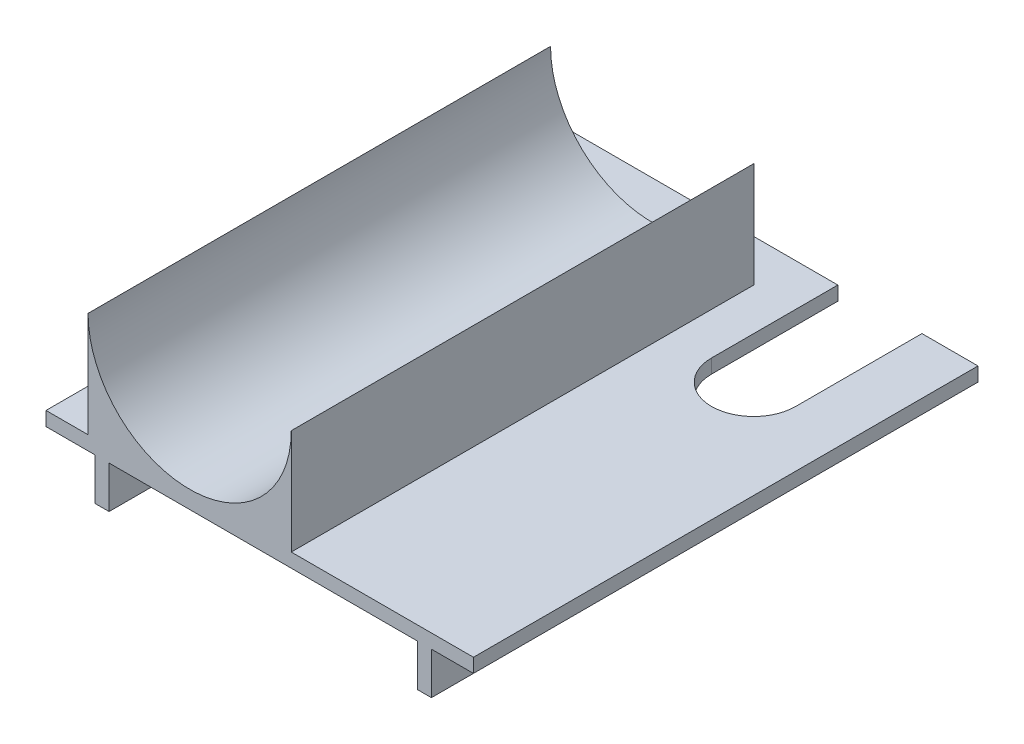
ISO-10303-21;
HEADER;
FILE_DESCRIPTION(('STEP AP214'),'2;1');
FILE_NAME('part.step','',(''),(''),'','','');
FILE_SCHEMA(('AUTOMOTIVE_DESIGN { 1 0 10303 214 1 1 1 1 }'));
ENDSEC;
DATA;
#1=APPLICATION_CONTEXT('core data for automotive mechanical design processes');
#2=APPLICATION_PROTOCOL_DEFINITION('international standard','automotive_design',2000,#1);
#3=PRODUCT_CONTEXT('',#1,'mechanical');
#4=PRODUCT('Part','Part','',(#3));
#5=PRODUCT_RELATED_PRODUCT_CATEGORY('part','',(#4));
#6=PRODUCT_DEFINITION_FORMATION('','',#4);
#7=PRODUCT_DEFINITION_CONTEXT('part definition',#1,'design');
#8=PRODUCT_DEFINITION('design','',#6,#7);
#9=PRODUCT_DEFINITION_SHAPE('','',#8);
#10=(LENGTH_UNIT() NAMED_UNIT(*) SI_UNIT(.MILLI.,.METRE.));
#11=(NAMED_UNIT(*) PLANE_ANGLE_UNIT() SI_UNIT($,.RADIAN.));
#12=(NAMED_UNIT(*) SI_UNIT($,.STERADIAN.) SOLID_ANGLE_UNIT());
#13=UNCERTAINTY_MEASURE_WITH_UNIT(LENGTH_MEASURE(1.E-05),#10,'distance_accuracy_value','');
#14=(GEOMETRIC_REPRESENTATION_CONTEXT(3) GLOBAL_UNCERTAINTY_ASSIGNED_CONTEXT((#13)) GLOBAL_UNIT_ASSIGNED_CONTEXT((#10,
#11,#12)) REPRESENTATION_CONTEXT('',''));
#15=CARTESIAN_POINT('',(0.,0.,0.));
#16=DIRECTION('',(0.,0.,1.));
#17=DIRECTION('',(1.,0.,0.));
#18=AXIS2_PLACEMENT_3D('',#15,#16,#17);
#19=CARTESIAN_POINT('',(-72.5,77.4999999999999,-360.));
#20=DIRECTION('',(-1.,0.,0.));
#21=DIRECTION('',(0.,0.,1.));
#22=AXIS2_PLACEMENT_3D('',#19,#20,#21);
#23=PLANE('',#22);
#24=DIRECTION('',(0.,0.,1.));
#25=VECTOR('',#24,1.);
#26=CARTESIAN_POINT('',(-72.5,77.4999999999999,-360.));
#27=LINE('',#26,#25);
#28=CARTESIAN_POINT('',(-72.5,77.4999999999999,-330.));
#29=VERTEX_POINT('',#28);
#30=CARTESIAN_POINT('',(-72.5,77.4999999999999,0.));
#31=VERTEX_POINT('',#30);
#32=EDGE_CURVE('E246',#29,#31,#27,.T.);
#33=ORIENTED_EDGE('',*,*,#32,.F.);
#34=DIRECTION('',(0.,-1.,0.));
#35=VECTOR('',#34,1.);
#36=CARTESIAN_POINT('',(-72.5,0.,-330.));
#37=LINE('',#36,#35);
#38=CARTESIAN_POINT('',(-72.5,2.49999999999995,-330.));
#39=VERTEX_POINT('',#38);
#40=EDGE_CURVE('E451',#29,#39,#37,.T.);
#41=ORIENTED_EDGE('',*,*,#40,.T.);
#42=DIRECTION('',(0.,0.,1.));
#43=VECTOR('',#42,1.);
#44=CARTESIAN_POINT('',(-72.5,2.49999999999995,-360.));
#45=LINE('',#44,#43);
#46=CARTESIAN_POINT('',(-72.5,2.49999999999995,0.));
#47=VERTEX_POINT('',#46);
#48=EDGE_CURVE('E244',#39,#47,#45,.T.);
#49=ORIENTED_EDGE('',*,*,#48,.T.);
#50=DIRECTION('',(0.,-1.,0.));
#51=VECTOR('',#50,1.);
#52=CARTESIAN_POINT('',(-72.5,77.4999999999999,0.));
#53=LINE('',#52,#51);
#54=EDGE_CURVE('E214',#31,#47,#53,.T.);
#55=ORIENTED_EDGE('',*,*,#54,.F.);
#56=EDGE_LOOP('',(#33,#41,#49,#55));
#57=FACE_BOUND('',#56,.T.);
#58=ADVANCED_FACE('F36',(#57),#23,.T.);
#59=CARTESIAN_POINT('',(0.,77.4999999999999,-360.));
#60=DIRECTION('',(0.,0.,1.));
#61=DIRECTION('',(1.,0.,0.));
#62=AXIS2_PLACEMENT_3D('',#59,#60,#61);
#63=CYLINDRICAL_SURFACE('',#62,72.5);
#64=DIRECTION('',(0.,0.,1.));
#65=VECTOR('',#64,1.);
#66=CARTESIAN_POINT('',(72.5,77.4999999999999,-360.));
#67=LINE('',#66,#65);
#68=CARTESIAN_POINT('',(72.5,77.4999999999999,-330.));
#69=VERTEX_POINT('',#68);
#70=CARTESIAN_POINT('',(72.5,77.4999999999999,0.));
#71=VERTEX_POINT('',#70);
#72=EDGE_CURVE('E248',#69,#71,#67,.T.);
#73=ORIENTED_EDGE('',*,*,#72,.F.);
#74=CARTESIAN_POINT('',(0.,77.4999999999999,-330.));
#75=DIRECTION('',(0.,0.,-1.));
#76=DIRECTION('',(-1.,0.,0.));
#77=AXIS2_PLACEMENT_3D('',#74,#75,#76);
#78=CIRCLE('',#77,72.5);
#79=EDGE_CURVE('E430',#69,#29,#78,.T.);
#80=ORIENTED_EDGE('',*,*,#79,.T.);
#81=ORIENTED_EDGE('',*,*,#32,.T.);
#82=CARTESIAN_POINT('',(0.,77.4999999999999,0.));
#83=DIRECTION('',(0.,0.,-1.));
#84=DIRECTION('',(1.,0.,0.));
#85=AXIS2_PLACEMENT_3D('',#82,#83,#84);
#86=CIRCLE('',#85,72.5);
#87=EDGE_CURVE('E211',#71,#31,#86,.T.);
#88=ORIENTED_EDGE('',*,*,#87,.F.);
#89=EDGE_LOOP('',(#73,#80,#81,#88));
#90=FACE_BOUND('',#89,.T.);
#91=ADVANCED_FACE('F292',(#90),#63,.F.);
#92=CARTESIAN_POINT('',(72.5,77.4999999999999,-360.));
#93=DIRECTION('',(1.,0.,0.));
#94=DIRECTION('',(0.,1.,0.));
#95=AXIS2_PLACEMENT_3D('',#92,#93,#94);
#96=PLANE('',#95);
#97=DIRECTION('',(0.,0.,1.));
#98=VECTOR('',#97,1.);
#99=CARTESIAN_POINT('',(72.5,2.49999999999995,-360.));
#100=LINE('',#99,#98);
#101=CARTESIAN_POINT('',(72.5,2.49999999999995,-330.));
#102=VERTEX_POINT('',#101);
#103=CARTESIAN_POINT('',(72.5,2.49999999999995,0.));
#104=VERTEX_POINT('',#103);
#105=EDGE_CURVE('E250',#102,#104,#100,.T.);
#106=ORIENTED_EDGE('',*,*,#105,.F.);
#107=DIRECTION('',(0.,1.,0.));
#108=VECTOR('',#107,1.);
#109=CARTESIAN_POINT('',(72.5,77.4999999999999,-330.));
#110=LINE('',#109,#108);
#111=EDGE_CURVE('E424',#102,#69,#110,.T.);
#112=ORIENTED_EDGE('',*,*,#111,.T.);
#113=ORIENTED_EDGE('',*,*,#72,.T.);
#114=DIRECTION('',(0.,1.,0.));
#115=VECTOR('',#114,1.);
#116=CARTESIAN_POINT('',(72.5,77.4999999999999,0.));
#117=LINE('',#116,#115);
#118=EDGE_CURVE('E208',#104,#71,#117,.T.);
#119=ORIENTED_EDGE('',*,*,#118,.F.);
#120=EDGE_LOOP('',(#106,#112,#113,#119));
#121=FACE_BOUND('',#120,.T.);
#122=ADVANCED_FACE('F288',(#121),#96,.T.);
#123=CARTESIAN_POINT('',(162.5,-7.50000000000005,-360.));
#124=DIRECTION('',(-1.,0.,0.));
#125=DIRECTION('',(0.,0.,1.));
#126=AXIS2_PLACEMENT_3D('',#123,#124,#125);
#127=PLANE('',#126);
#128=DIRECTION('',(0.,1.,0.));
#129=VECTOR('',#128,1.);
#130=CARTESIAN_POINT('',(162.5,-357.5,-269.791666666683));
#131=LINE('',#130,#129);
#132=CARTESIAN_POINT('',(162.5,-37.5000000000001,-269.791666666681));
#133=VERTEX_POINT('',#132);
#134=CARTESIAN_POINT('',(162.5,-7.50000000000001,-269.791666666683));
#135=VERTEX_POINT('',#134);
#136=EDGE_CURVE('E354',#133,#135,#131,.T.);
#137=ORIENTED_EDGE('',*,*,#136,.F.);
#138=DIRECTION('',(0.,0.,1.));
#139=VECTOR('',#138,1.);
#140=CARTESIAN_POINT('',(162.5,-37.5,-360.));
#141=LINE('',#140,#139);
#142=CARTESIAN_POINT('',(162.5,-37.5,0.));
#143=VERTEX_POINT('',#142);
#144=EDGE_CURVE('E40',#133,#143,#141,.T.);
#145=ORIENTED_EDGE('',*,*,#144,.T.);
#146=DIRECTION('',(0.,-1.,0.));
#147=VECTOR('',#146,1.);
#148=CARTESIAN_POINT('',(162.5,-7.50000000000005,0.));
#149=LINE('',#148,#147);
#150=CARTESIAN_POINT('',(162.5,-7.50000000000005,0.));
#151=VERTEX_POINT('',#150);
#152=EDGE_CURVE('E189',#151,#143,#149,.T.);
#153=ORIENTED_EDGE('',*,*,#152,.F.);
#154=DIRECTION('',(0.,0.,1.));
#155=VECTOR('',#154,1.);
#156=CARTESIAN_POINT('',(162.5,-7.50000000000005,-360.));
#157=LINE('',#156,#155);
#158=EDGE_CURVE('E118',#135,#151,#157,.T.);
#159=ORIENTED_EDGE('',*,*,#158,.F.);
#160=EDGE_LOOP('',(#137,#145,#153,#159));
#161=FACE_BOUND('',#160,.T.);
#162=ADVANCED_FACE('F291',(#161),#127,.T.);
#163=CARTESIAN_POINT('',(0.,77.4999999999999,-360.));
#164=DIRECTION('',(0.,0.,1.));
#165=DIRECTION('',(1.,0.,0.));
#166=AXIS2_PLACEMENT_3D('',#163,#164,#165);
#167=PLANE('',#166);
#168=DIRECTION('',(0.,-1.,0.));
#169=VECTOR('',#168,1.);
#170=CARTESIAN_POINT('',(162.5,-7.50000000000005,-360.));
#171=LINE('',#170,#169);
#172=CARTESIAN_POINT('',(162.5,2.49999999999995,-360.));
#173=VERTEX_POINT('',#172);
#174=CARTESIAN_POINT('',(162.5,-37.5,-360.));
#175=VERTEX_POINT('',#174);
#176=EDGE_CURVE('E235',#173,#175,#171,.T.);
#177=ORIENTED_EDGE('',*,*,#176,.F.);
#178=DIRECTION('',(-1.,0.,0.));
#179=VECTOR('',#178,1.);
#180=CARTESIAN_POINT('',(72.5,2.49999999999995,-360.));
#181=LINE('',#180,#179);
#182=CARTESIAN_POINT('',(202.5,2.49999999999995,-360.));
#183=VERTEX_POINT('',#182);
#184=EDGE_CURVE('E381',#183,#173,#181,.T.);
#185=ORIENTED_EDGE('',*,*,#184,.F.);
#186=DIRECTION('',(0.,1.,0.));
#187=VECTOR('',#186,1.);
#188=CARTESIAN_POINT('',(202.5,-7.50000000000005,-360.));
#189=LINE('',#188,#187);
#190=CARTESIAN_POINT('',(202.5,-7.50000000000005,-360.));
#191=VERTEX_POINT('',#190);
#192=EDGE_CURVE('E386',#191,#183,#189,.T.);
#193=ORIENTED_EDGE('',*,*,#192,.F.);
#194=DIRECTION('',(1.,0.,0.));
#195=VECTOR('',#194,1.);
#196=CARTESIAN_POINT('',(172.5,-7.50000000000005,-360.));
#197=LINE('',#196,#195);
#198=CARTESIAN_POINT('',(172.5,-7.50000000000005,-360.));
#199=VERTEX_POINT('',#198);
#200=EDGE_CURVE('E389',#199,#191,#197,.T.);
#201=ORIENTED_EDGE('',*,*,#200,.F.);
#202=DIRECTION('',(0.,1.,0.));
#203=VECTOR('',#202,1.);
#204=CARTESIAN_POINT('',(172.5,-37.5,-360.));
#205=LINE('',#204,#203);
#206=CARTESIAN_POINT('',(172.5,-37.5,-360.));
#207=VERTEX_POINT('',#206);
#208=EDGE_CURVE('E392',#207,#199,#205,.T.);
#209=ORIENTED_EDGE('',*,*,#208,.F.);
#210=DIRECTION('',(1.,0.,0.));
#211=VECTOR('',#210,1.);
#212=CARTESIAN_POINT('',(162.5,-37.5,-360.));
#213=LINE('',#212,#211);
#214=EDGE_CURVE('E395',#175,#207,#213,.T.);
#215=ORIENTED_EDGE('',*,*,#214,.F.);
#216=EDGE_LOOP('',(#177,#185,#193,#201,#209,#215));
#217=FACE_BOUND('',#216,.T.);
#218=ADVANCED_FACE('F329',(#217),#167,.F.);
#219=DIRECTION('',(0.,1.,0.));
#220=VECTOR('',#219,1.);
#221=CARTESIAN_POINT('',(162.5,-357.5,-270.));
#222=LINE('',#221,#220);
#223=CARTESIAN_POINT('',(162.5,-37.5000000000002,-270.));
#224=VERTEX_POINT('',#223);
#225=CARTESIAN_POINT('',(162.5,2.49999999999995,-270.));
#226=VERTEX_POINT('',#225);
#227=EDGE_CURVE('E344',#224,#226,#222,.T.);
#228=ORIENTED_EDGE('',*,*,#227,.T.);
#229=DIRECTION('',(0.,0.,-1.));
#230=VECTOR('',#229,1.);
#231=CARTESIAN_POINT('',(162.5,2.49999999999995,-270.));
#232=LINE('',#231,#230);
#233=EDGE_CURVE('E360',#226,#173,#232,.T.);
#234=ORIENTED_EDGE('',*,*,#233,.T.);
#235=ORIENTED_EDGE('',*,*,#176,.T.);
#236=EDGE_CURVE('E127',#175,#224,#141,.T.);
#237=ORIENTED_EDGE('',*,*,#236,.T.);
#238=EDGE_LOOP('',(#228,#234,#235,#237));
#239=FACE_BOUND('',#238,.T.);
#240=ADVANCED_FACE('F38',(#239),#127,.T.);
#241=CARTESIAN_POINT('',(67.5,-7.50000000000004,-360.));
#242=DIRECTION('',(0.,-1.,0.));
#243=DIRECTION('',(1.,0.,0.));
#244=AXIS2_PLACEMENT_3D('',#241,#242,#243);
#245=PLANE('',#244);
#246=CARTESIAN_POINT('',(132.5,-7.50000000000012,-269.895833333339));
#247=DIRECTION('',(0.,-1.,0.));
#248=DIRECTION('',(1.,0.,0.));
#249=AXIS2_PLACEMENT_3D('',#246,#247,#248);
#250=CIRCLE('',#249,30.0001808443623);
#251=CARTESIAN_POINT('',(102.5,-7.50000000000017,-270.));
#252=VERTEX_POINT('',#251);
#253=EDGE_CURVE('E193',#135,#252,#250,.T.);
#254=ORIENTED_EDGE('',*,*,#253,.F.);
#255=ORIENTED_EDGE('',*,*,#158,.T.);
#256=DIRECTION('',(1.,0.,0.));
#257=VECTOR('',#256,1.);
#258=CARTESIAN_POINT('',(67.5,-7.50000000000004,0.));
#259=LINE('',#258,#257);
#260=CARTESIAN_POINT('',(-57.5,-7.50000000000006,0.));
#261=VERTEX_POINT('',#260);
#262=EDGE_CURVE('E232',#261,#151,#259,.T.);
#263=ORIENTED_EDGE('',*,*,#262,.F.);
#264=DIRECTION('',(0.,0.,1.));
#265=VECTOR('',#264,1.);
#266=CARTESIAN_POINT('',(-57.5,-7.50000000000006,-360.));
#267=LINE('',#266,#265);
#268=CARTESIAN_POINT('',(-57.5,-7.50000000000006,-360.));
#269=VERTEX_POINT('',#268);
#270=EDGE_CURVE('E62',#269,#261,#267,.T.);
#271=ORIENTED_EDGE('',*,*,#270,.F.);
#272=DIRECTION('',(1.,0.,0.));
#273=VECTOR('',#272,1.);
#274=CARTESIAN_POINT('',(-57.5,-7.50000000000006,-360.));
#275=LINE('',#274,#273);
#276=CARTESIAN_POINT('',(102.5,-7.50000000000004,-360.));
#277=VERTEX_POINT('',#276);
#278=EDGE_CURVE('E187',#269,#277,#275,.T.);
#279=ORIENTED_EDGE('',*,*,#278,.T.);
#280=DIRECTION('',(0.,0.,-1.));
#281=VECTOR('',#280,1.);
#282=CARTESIAN_POINT('',(102.5,-7.50000000000004,-360.));
#283=LINE('',#282,#281);
#284=EDGE_CURVE('E53',#252,#277,#283,.T.);
#285=ORIENTED_EDGE('',*,*,#284,.F.);
#286=EDGE_LOOP('',(#254,#255,#263,#271,#279,#285));
#287=FACE_BOUND('',#286,.T.);
#288=ADVANCED_FACE('F318',(#287),#245,.T.);
#289=CARTESIAN_POINT('',(-57.5,-37.5,-360.));
#290=DIRECTION('',(1.,0.,0.));
#291=DIRECTION('',(0.,0.,-1.));
#292=AXIS2_PLACEMENT_3D('',#289,#290,#291);
#293=PLANE('',#292);
#294=DIRECTION('',(0.,1.,0.));
#295=VECTOR('',#294,1.);
#296=CARTESIAN_POINT('',(-57.5,-37.5,0.));
#297=LINE('',#296,#295);
#298=CARTESIAN_POINT('',(-57.5,-37.5,0.));
#299=VERTEX_POINT('',#298);
#300=EDGE_CURVE('E229',#299,#261,#297,.T.);
#301=ORIENTED_EDGE('',*,*,#300,.F.);
#302=DIRECTION('',(0.,0.,1.));
#303=VECTOR('',#302,1.);
#304=CARTESIAN_POINT('',(-57.5,-37.5,-360.));
#305=LINE('',#304,#303);
#306=CARTESIAN_POINT('',(-57.5,-37.5,-360.));
#307=VERTEX_POINT('',#306);
#308=EDGE_CURVE('E165',#307,#299,#305,.T.);
#309=ORIENTED_EDGE('',*,*,#308,.F.);
#310=DIRECTION('',(0.,1.,0.));
#311=VECTOR('',#310,1.);
#312=CARTESIAN_POINT('',(-57.5,-37.5,-360.));
#313=LINE('',#312,#311);
#314=EDGE_CURVE('E177',#307,#269,#313,.T.);
#315=ORIENTED_EDGE('',*,*,#314,.T.);
#316=ORIENTED_EDGE('',*,*,#270,.T.);
#317=EDGE_LOOP('',(#301,#309,#315,#316));
#318=FACE_BOUND('',#317,.T.);
#319=ADVANCED_FACE('F315',(#318),#293,.T.);
#320=CARTESIAN_POINT('',(-67.5,-37.5000000000001,-360.));
#321=DIRECTION('',(0.,-1.,0.));
#322=DIRECTION('',(1.,0.,0.));
#323=AXIS2_PLACEMENT_3D('',#320,#321,#322);
#324=PLANE('',#323);
#325=DIRECTION('',(1.,0.,0.));
#326=VECTOR('',#325,1.);
#327=CARTESIAN_POINT('',(-67.5,-37.5000000000001,0.));
#328=LINE('',#327,#326);
#329=CARTESIAN_POINT('',(-67.5,-37.5000000000001,0.));
#330=VERTEX_POINT('',#329);
#331=EDGE_CURVE('E160',#330,#299,#328,.T.);
#332=ORIENTED_EDGE('',*,*,#331,.F.);
#333=DIRECTION('',(0.,0.,1.));
#334=VECTOR('',#333,1.);
#335=CARTESIAN_POINT('',(-67.5,-37.5000000000001,-360.));
#336=LINE('',#335,#334);
#337=CARTESIAN_POINT('',(-67.5,-37.5000000000001,-360.));
#338=VERTEX_POINT('',#337);
#339=EDGE_CURVE('E155',#338,#330,#336,.T.);
#340=ORIENTED_EDGE('',*,*,#339,.F.);
#341=DIRECTION('',(1.,0.,0.));
#342=VECTOR('',#341,1.);
#343=CARTESIAN_POINT('',(-67.5,-37.5000000000001,-360.));
#344=LINE('',#343,#342);
#345=EDGE_CURVE('E158',#338,#307,#344,.T.);
#346=ORIENTED_EDGE('',*,*,#345,.T.);
#347=ORIENTED_EDGE('',*,*,#308,.T.);
#348=EDGE_LOOP('',(#332,#340,#346,#347));
#349=FACE_BOUND('',#348,.T.);
#350=ADVANCED_FACE('F157',(#349),#324,.T.);
#351=CARTESIAN_POINT('',(-67.5,-7.50000000000006,-360.));
#352=DIRECTION('',(-1.,0.,0.));
#353=DIRECTION('',(0.,-1.,0.));
#354=AXIS2_PLACEMENT_3D('',#351,#352,#353);
#355=PLANE('',#354);
#356=DIRECTION('',(0.,-1.,0.));
#357=VECTOR('',#356,1.);
#358=CARTESIAN_POINT('',(-67.5,-7.50000000000006,0.));
#359=LINE('',#358,#357);
#360=CARTESIAN_POINT('',(-67.5,-7.50000000000006,0.));
#361=VERTEX_POINT('',#360);
#362=EDGE_CURVE('E226',#361,#330,#359,.T.);
#363=ORIENTED_EDGE('',*,*,#362,.F.);
#364=DIRECTION('',(0.,0.,1.));
#365=VECTOR('',#364,1.);
#366=CARTESIAN_POINT('',(-67.5,-7.50000000000006,-360.));
#367=LINE('',#366,#365);
#368=CARTESIAN_POINT('',(-67.5,-7.50000000000006,-360.));
#369=VERTEX_POINT('',#368);
#370=EDGE_CURVE('E166',#369,#361,#367,.T.);
#371=ORIENTED_EDGE('',*,*,#370,.F.);
#372=DIRECTION('',(0.,-1.,0.));
#373=VECTOR('',#372,1.);
#374=CARTESIAN_POINT('',(-67.5,-7.50000000000006,-360.));
#375=LINE('',#374,#373);
#376=EDGE_CURVE('E174',#369,#338,#375,.T.);
#377=ORIENTED_EDGE('',*,*,#376,.T.);
#378=ORIENTED_EDGE('',*,*,#339,.T.);
#379=EDGE_LOOP('',(#363,#371,#377,#378));
#380=FACE_BOUND('',#379,.T.);
#381=ADVANCED_FACE('F179',(#380),#355,.T.);
#382=CARTESIAN_POINT('',(-102.5,-7.50000000000005,-360.));
#383=DIRECTION('',(0.,-1.,0.));
#384=DIRECTION('',(1.,0.,0.));
#385=AXIS2_PLACEMENT_3D('',#382,#383,#384);
#386=PLANE('',#385);
#387=DIRECTION('',(1.,0.,0.));
#388=VECTOR('',#387,1.);
#389=CARTESIAN_POINT('',(-102.5,-7.50000000000005,0.));
#390=LINE('',#389,#388);
#391=CARTESIAN_POINT('',(-102.5,-7.50000000000005,0.));
#392=VERTEX_POINT('',#391);
#393=EDGE_CURVE('E223',#392,#361,#390,.T.);
#394=ORIENTED_EDGE('',*,*,#393,.F.);
#395=DIRECTION('',(0.,0.,1.));
#396=VECTOR('',#395,1.);
#397=CARTESIAN_POINT('',(-102.5,-7.50000000000005,-360.));
#398=LINE('',#397,#396);
#399=CARTESIAN_POINT('',(-102.5,-7.50000000000005,-360.));
#400=VERTEX_POINT('',#399);
#401=EDGE_CURVE('E240',#400,#392,#398,.T.);
#402=ORIENTED_EDGE('',*,*,#401,.F.);
#403=DIRECTION('',(1.,0.,0.));
#404=VECTOR('',#403,1.);
#405=CARTESIAN_POINT('',(-102.5,-7.50000000000005,-360.));
#406=LINE('',#405,#404);
#407=EDGE_CURVE('E180',#400,#369,#406,.T.);
#408=ORIENTED_EDGE('',*,*,#407,.T.);
#409=ORIENTED_EDGE('',*,*,#370,.T.);
#410=EDGE_LOOP('',(#394,#402,#408,#409));
#411=FACE_BOUND('',#410,.T.);
#412=ADVANCED_FACE('F306',(#411),#386,.T.);
#413=CARTESIAN_POINT('',(-102.5,2.49999999999995,-360.));
#414=DIRECTION('',(-1.,0.,0.));
#415=DIRECTION('',(0.,0.,1.));
#416=AXIS2_PLACEMENT_3D('',#413,#414,#415);
#417=PLANE('',#416);
#418=DIRECTION('',(0.,-1.,0.));
#419=VECTOR('',#418,1.);
#420=CARTESIAN_POINT('',(-102.5,2.49999999999995,0.));
#421=LINE('',#420,#419);
#422=CARTESIAN_POINT('',(-102.5,2.49999999999995,0.));
#423=VERTEX_POINT('',#422);
#424=EDGE_CURVE('E220',#423,#392,#421,.T.);
#425=ORIENTED_EDGE('',*,*,#424,.F.);
#426=DIRECTION('',(0.,0.,1.));
#427=VECTOR('',#426,1.);
#428=CARTESIAN_POINT('',(-102.5,2.49999999999995,-360.));
#429=LINE('',#428,#427);
#430=CARTESIAN_POINT('',(-102.5,2.49999999999995,-360.));
#431=VERTEX_POINT('',#430);
#432=EDGE_CURVE('E242',#431,#423,#429,.T.);
#433=ORIENTED_EDGE('',*,*,#432,.F.);
#434=DIRECTION('',(0.,-1.,0.));
#435=VECTOR('',#434,1.);
#436=CARTESIAN_POINT('',(-102.5,2.49999999999995,-360.));
#437=LINE('',#436,#435);
#438=EDGE_CURVE('E182',#431,#400,#437,.T.);
#439=ORIENTED_EDGE('',*,*,#438,.T.);
#440=ORIENTED_EDGE('',*,*,#401,.T.);
#441=EDGE_LOOP('',(#425,#433,#439,#440));
#442=FACE_BOUND('',#441,.T.);
#443=ADVANCED_FACE('F302',(#442),#417,.T.);
#444=CARTESIAN_POINT('',(-72.5,2.49999999999995,-360.));
#445=DIRECTION('',(0.,1.,0.));
#446=DIRECTION('',(-1.,0.,0.));
#447=AXIS2_PLACEMENT_3D('',#444,#445,#446);
#448=PLANE('',#447);
#449=DIRECTION('',(-1.,0.,0.));
#450=VECTOR('',#449,1.);
#451=CARTESIAN_POINT('',(-72.5,2.49999999999995,0.));
#452=LINE('',#451,#450);
#453=EDGE_CURVE('E217',#47,#423,#452,.T.);
#454=ORIENTED_EDGE('',*,*,#453,.F.);
#455=ORIENTED_EDGE('',*,*,#48,.F.);
#456=DIRECTION('',(-1.,0.,0.));
#457=VECTOR('',#456,1.);
#458=CARTESIAN_POINT('',(202.5,2.49999999999995,-330.));
#459=LINE('',#458,#457);
#460=EDGE_CURVE('E448',#102,#39,#459,.T.);
#461=ORIENTED_EDGE('',*,*,#460,.F.);
#462=ORIENTED_EDGE('',*,*,#105,.T.);
#463=DIRECTION('',(-1.,0.,0.));
#464=VECTOR('',#463,1.);
#465=CARTESIAN_POINT('',(72.5,2.49999999999995,0.));
#466=LINE('',#465,#464);
#467=CARTESIAN_POINT('',(202.5,2.49999999999995,0.));
#468=VERTEX_POINT('',#467);
#469=EDGE_CURVE('E205',#468,#104,#466,.T.);
#470=ORIENTED_EDGE('',*,*,#469,.F.);
#471=DIRECTION('',(0.,0.,1.));
#472=VECTOR('',#471,1.);
#473=CARTESIAN_POINT('',(202.5,2.49999999999995,-360.));
#474=LINE('',#473,#472);
#475=EDGE_CURVE('E252',#183,#468,#474,.T.);
#476=ORIENTED_EDGE('',*,*,#475,.F.);
#477=ORIENTED_EDGE('',*,*,#184,.T.);
#478=ORIENTED_EDGE('',*,*,#233,.F.);
#479=CARTESIAN_POINT('',(132.5,2.49999999999995,-269.895833333339));
#480=DIRECTION('',(0.,1.,0.));
#481=DIRECTION('',(-1.,0.,0.));
#482=AXIS2_PLACEMENT_3D('',#479,#480,#481);
#483=CIRCLE('',#482,30.0001808443623);
#484=CARTESIAN_POINT('',(102.5,2.49999999999995,-270.));
#485=VERTEX_POINT('',#484);
#486=EDGE_CURVE('E442',#485,#226,#483,.T.);
#487=ORIENTED_EDGE('',*,*,#486,.F.);
#488=DIRECTION('',(0.,0.,1.));
#489=VECTOR('',#488,1.);
#490=CARTESIAN_POINT('',(102.5,2.49999999999995,-360.));
#491=LINE('',#490,#489);
#492=CARTESIAN_POINT('',(102.5,2.49999999999995,-360.));
#493=VERTEX_POINT('',#492);
#494=EDGE_CURVE('E438',#493,#485,#491,.T.);
#495=ORIENTED_EDGE('',*,*,#494,.F.);
#496=DIRECTION('',(-1.,0.,0.));
#497=VECTOR('',#496,1.);
#498=CARTESIAN_POINT('',(-72.5,2.49999999999995,-360.));
#499=LINE('',#498,#497);
#500=EDGE_CURVE('E380',#493,#431,#499,.T.);
#501=ORIENTED_EDGE('',*,*,#500,.T.);
#502=ORIENTED_EDGE('',*,*,#432,.T.);
#503=EDGE_LOOP('',(#454,#455,#461,#462,#470,#476,#477,#478,#487,#495,#501,#502));
#504=FACE_BOUND('',#503,.T.);
#505=ADVANCED_FACE('F286',(#504),#448,.T.);
#506=CARTESIAN_POINT('',(202.5,-7.50000000000005,-360.));
#507=DIRECTION('',(1.,0.,0.));
#508=DIRECTION('',(0.,0.,-1.));
#509=AXIS2_PLACEMENT_3D('',#506,#507,#508);
#510=PLANE('',#509);
#511=DIRECTION('',(0.,1.,0.));
#512=VECTOR('',#511,1.);
#513=CARTESIAN_POINT('',(202.5,-7.50000000000005,0.));
#514=LINE('',#513,#512);
#515=CARTESIAN_POINT('',(202.5,-7.50000000000005,0.));
#516=VERTEX_POINT('',#515);
#517=EDGE_CURVE('E202',#516,#468,#514,.T.);
#518=ORIENTED_EDGE('',*,*,#517,.F.);
#519=DIRECTION('',(0.,0.,1.));
#520=VECTOR('',#519,1.);
#521=CARTESIAN_POINT('',(202.5,-7.50000000000005,-360.));
#522=LINE('',#521,#520);
#523=EDGE_CURVE('E254',#191,#516,#522,.T.);
#524=ORIENTED_EDGE('',*,*,#523,.F.);
#525=ORIENTED_EDGE('',*,*,#192,.T.);
#526=ORIENTED_EDGE('',*,*,#475,.T.);
#527=EDGE_LOOP('',(#518,#524,#525,#526));
#528=FACE_BOUND('',#527,.T.);
#529=ADVANCED_FACE('F282',(#528),#510,.T.);
#530=CARTESIAN_POINT('',(172.5,-7.50000000000005,-360.));
#531=DIRECTION('',(0.,-1.,0.));
#532=DIRECTION('',(1.,0.,0.));
#533=AXIS2_PLACEMENT_3D('',#530,#531,#532);
#534=PLANE('',#533);
#535=DIRECTION('',(1.,0.,0.));
#536=VECTOR('',#535,1.);
#537=CARTESIAN_POINT('',(172.5,-7.50000000000005,0.));
#538=LINE('',#537,#536);
#539=CARTESIAN_POINT('',(172.5,-7.50000000000005,0.));
#540=VERTEX_POINT('',#539);
#541=EDGE_CURVE('E199',#540,#516,#538,.T.);
#542=ORIENTED_EDGE('',*,*,#541,.F.);
#543=DIRECTION('',(0.,0.,1.));
#544=VECTOR('',#543,1.);
#545=CARTESIAN_POINT('',(172.5,-7.50000000000005,-360.));
#546=LINE('',#545,#544);
#547=EDGE_CURVE('E256',#199,#540,#546,.T.);
#548=ORIENTED_EDGE('',*,*,#547,.F.);
#549=ORIENTED_EDGE('',*,*,#200,.T.);
#550=ORIENTED_EDGE('',*,*,#523,.T.);
#551=EDGE_LOOP('',(#542,#548,#549,#550));
#552=FACE_BOUND('',#551,.T.);
#553=ADVANCED_FACE('F278',(#552),#534,.T.);
#554=CARTESIAN_POINT('',(172.5,-37.5,-360.));
#555=DIRECTION('',(1.,0.,0.));
#556=DIRECTION('',(0.,0.,-1.));
#557=AXIS2_PLACEMENT_3D('',#554,#555,#556);
#558=PLANE('',#557);
#559=DIRECTION('',(0.,1.,0.));
#560=VECTOR('',#559,1.);
#561=CARTESIAN_POINT('',(172.5,-37.5,0.));
#562=LINE('',#561,#560);
#563=CARTESIAN_POINT('',(172.5,-37.5,0.));
#564=VERTEX_POINT('',#563);
#565=EDGE_CURVE('E196',#564,#540,#562,.T.);
#566=ORIENTED_EDGE('',*,*,#565,.F.);
#567=DIRECTION('',(0.,0.,1.));
#568=VECTOR('',#567,1.);
#569=CARTESIAN_POINT('',(172.5,-37.5,-360.));
#570=LINE('',#569,#568);
#571=EDGE_CURVE('E258',#207,#564,#570,.T.);
#572=ORIENTED_EDGE('',*,*,#571,.F.);
#573=ORIENTED_EDGE('',*,*,#208,.T.);
#574=ORIENTED_EDGE('',*,*,#547,.T.);
#575=EDGE_LOOP('',(#566,#572,#573,#574));
#576=FACE_BOUND('',#575,.T.);
#577=ADVANCED_FACE('F275',(#576),#558,.T.);
#578=CARTESIAN_POINT('',(162.5,-37.5,-360.));
#579=DIRECTION('',(0.,-1.,0.));
#580=DIRECTION('',(0.,0.,-1.));
#581=AXIS2_PLACEMENT_3D('',#578,#579,#580);
#582=PLANE('',#581);
#583=CARTESIAN_POINT('',(132.5,-37.5000000000004,-269.895833333339));
#584=DIRECTION('',(0.,-1.,0.));
#585=DIRECTION('',(0.999993971890928,0.,-0.00347220129108495));
#586=AXIS2_PLACEMENT_3D('',#583,#584,#585);
#587=CIRCLE('',#586,30.0001808443623);
#588=EDGE_CURVE('E11',#224,#133,#587,.T.);
#589=ORIENTED_EDGE('',*,*,#588,.F.);
#590=ORIENTED_EDGE('',*,*,#236,.F.);
#591=ORIENTED_EDGE('',*,*,#214,.T.);
#592=ORIENTED_EDGE('',*,*,#571,.T.);
#593=DIRECTION('',(1.,0.,0.));
#594=VECTOR('',#593,1.);
#595=CARTESIAN_POINT('',(162.5,-37.5,0.));
#596=LINE('',#595,#594);
#597=EDGE_CURVE('E192',#143,#564,#596,.T.);
#598=ORIENTED_EDGE('',*,*,#597,.F.);
#599=ORIENTED_EDGE('',*,*,#144,.F.);
#600=EDGE_LOOP('',(#589,#590,#591,#592,#598,#599));
#601=FACE_BOUND('',#600,.T.);
#602=ADVANCED_FACE('F266',(#601),#582,.T.);
#603=ORIENTED_EDGE('',*,*,#500,.F.);
#604=DIRECTION('',(0.,-1.,0.));
#605=VECTOR('',#604,1.);
#606=CARTESIAN_POINT('',(102.5,77.4999999999999,-360.));
#607=LINE('',#606,#605);
#608=EDGE_CURVE('E46',#493,#277,#607,.T.);
#609=ORIENTED_EDGE('',*,*,#608,.T.);
#610=ORIENTED_EDGE('',*,*,#278,.F.);
#611=ORIENTED_EDGE('',*,*,#314,.F.);
#612=ORIENTED_EDGE('',*,*,#345,.F.);
#613=ORIENTED_EDGE('',*,*,#376,.F.);
#614=ORIENTED_EDGE('',*,*,#407,.F.);
#615=ORIENTED_EDGE('',*,*,#438,.F.);
#616=EDGE_LOOP('',(#603,#609,#610,#611,#612,#613,#614,#615));
#617=FACE_BOUND('',#616,.T.);
#618=ADVANCED_FACE('F172',(#617),#167,.F.);
#619=CARTESIAN_POINT('',(0.,77.4999999999999,0.));
#620=DIRECTION('',(0.,0.,1.));
#621=DIRECTION('',(1.,0.,0.));
#622=AXIS2_PLACEMENT_3D('',#619,#620,#621);
#623=PLANE('',#622);
#624=ORIENTED_EDGE('',*,*,#152,.T.);
#625=ORIENTED_EDGE('',*,*,#597,.T.);
#626=ORIENTED_EDGE('',*,*,#565,.T.);
#627=ORIENTED_EDGE('',*,*,#541,.T.);
#628=ORIENTED_EDGE('',*,*,#517,.T.);
#629=ORIENTED_EDGE('',*,*,#469,.T.);
#630=ORIENTED_EDGE('',*,*,#118,.T.);
#631=ORIENTED_EDGE('',*,*,#87,.T.);
#632=ORIENTED_EDGE('',*,*,#54,.T.);
#633=ORIENTED_EDGE('',*,*,#453,.T.);
#634=ORIENTED_EDGE('',*,*,#424,.T.);
#635=ORIENTED_EDGE('',*,*,#393,.T.);
#636=ORIENTED_EDGE('',*,*,#362,.T.);
#637=ORIENTED_EDGE('',*,*,#331,.T.);
#638=ORIENTED_EDGE('',*,*,#300,.T.);
#639=ORIENTED_EDGE('',*,*,#262,.T.);
#640=EDGE_LOOP('',(#624,#625,#626,#627,#628,#629,#630,#631,#632,#633,#634,#635,#636,#637,#638,#639));
#641=FACE_BOUND('',#640,.T.);
#642=ADVANCED_FACE('F322',(#641),#623,.T.);
#643=CARTESIAN_POINT('',(132.5,-357.5,-269.895833333339));
#644=DIRECTION('',(0.,1.,0.));
#645=DIRECTION('',(-1.,0.,0.));
#646=AXIS2_PLACEMENT_3D('',#643,#644,#645);
#647=CYLINDRICAL_SURFACE('',#646,30.0001808443623);
#648=ORIENTED_EDGE('',*,*,#253,.T.);
#649=DIRECTION('',(0.,1.,0.));
#650=VECTOR('',#649,1.);
#651=CARTESIAN_POINT('',(102.5,-357.5,-270.));
#652=LINE('',#651,#650);
#653=EDGE_CURVE('E353',#252,#485,#652,.T.);
#654=ORIENTED_EDGE('',*,*,#653,.T.);
#655=ORIENTED_EDGE('',*,*,#486,.T.);
#656=ORIENTED_EDGE('',*,*,#227,.F.);
#657=ORIENTED_EDGE('',*,*,#588,.T.);
#658=ORIENTED_EDGE('',*,*,#136,.T.);
#659=EDGE_LOOP('',(#648,#654,#655,#656,#657,#658));
#660=FACE_BOUND('',#659,.T.);
#661=ADVANCED_FACE('F325',(#660),#647,.F.);
#662=CARTESIAN_POINT('',(102.5,-357.5,-360.));
#663=DIRECTION('',(-1.,0.,0.));
#664=DIRECTION('',(0.,0.,1.));
#665=AXIS2_PLACEMENT_3D('',#662,#663,#664);
#666=PLANE('',#665);
#667=ORIENTED_EDGE('',*,*,#284,.T.);
#668=ORIENTED_EDGE('',*,*,#608,.F.);
#669=ORIENTED_EDGE('',*,*,#494,.T.);
#670=ORIENTED_EDGE('',*,*,#653,.F.);
#671=EDGE_LOOP('',(#667,#668,#669,#670));
#672=FACE_BOUND('',#671,.T.);
#673=ADVANCED_FACE('F330',(#672),#666,.F.);
#674=CARTESIAN_POINT('',(202.5,0.,-330.));
#675=DIRECTION('',(0.,0.,-1.));
#676=DIRECTION('',(-1.,0.,0.));
#677=AXIS2_PLACEMENT_3D('',#674,#675,#676);
#678=PLANE('',#677);
#679=ORIENTED_EDGE('',*,*,#111,.F.);
#680=ORIENTED_EDGE('',*,*,#460,.T.);
#681=ORIENTED_EDGE('',*,*,#40,.F.);
#682=ORIENTED_EDGE('',*,*,#79,.F.);
#683=EDGE_LOOP('',(#679,#680,#681,#682));
#684=FACE_BOUND('',#683,.T.);
#685=ADVANCED_FACE('F333',(#684),#678,.T.);
#686=CLOSED_SHELL('',(#58,#91,#122,#162,#218,#240,#288,#319,#350,#381,#412,#443,#505,#529,#553,
#577,#602,#618,#642,#661,#673,#685));
#687=MANIFOLD_SOLID_BREP('B2',#686);
#688=ADVANCED_BREP_SHAPE_REPRESENTATION('',(#18,#687),#14);
#689=SHAPE_DEFINITION_REPRESENTATION(#9,#688);
ENDSEC;
END-ISO-10303-21;
